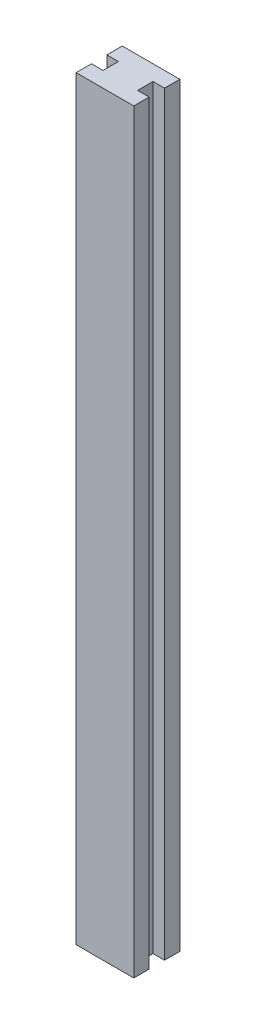
ISO-10303-21;
HEADER;
FILE_DESCRIPTION(('STEP AP214'),'2;1');
FILE_NAME('part.step','',(''),(''),'','','');
FILE_SCHEMA(('AUTOMOTIVE_DESIGN { 1 0 10303 214 1 1 1 1 }'));
ENDSEC;
DATA;
#1=APPLICATION_CONTEXT('core data for automotive mechanical design processes');
#2=APPLICATION_PROTOCOL_DEFINITION('international standard','automotive_design',2000,#1);
#3=PRODUCT_CONTEXT('',#1,'mechanical');
#4=PRODUCT('Part','Part','',(#3));
#5=PRODUCT_RELATED_PRODUCT_CATEGORY('part','',(#4));
#6=PRODUCT_DEFINITION_FORMATION('','',#4);
#7=PRODUCT_DEFINITION_CONTEXT('part definition',#1,'design');
#8=PRODUCT_DEFINITION('design','',#6,#7);
#9=PRODUCT_DEFINITION_SHAPE('','',#8);
#10=(LENGTH_UNIT() NAMED_UNIT(*) SI_UNIT(.MILLI.,.METRE.));
#11=(NAMED_UNIT(*) PLANE_ANGLE_UNIT() SI_UNIT($,.RADIAN.));
#12=(NAMED_UNIT(*) SI_UNIT($,.STERADIAN.) SOLID_ANGLE_UNIT());
#13=UNCERTAINTY_MEASURE_WITH_UNIT(LENGTH_MEASURE(1.E-05),#10,'distance_accuracy_value','');
#14=(GEOMETRIC_REPRESENTATION_CONTEXT(3) GLOBAL_UNCERTAINTY_ASSIGNED_CONTEXT((#13)) GLOBAL_UNIT_ASSIGNED_CONTEXT((#10,
#11,#12)) REPRESENTATION_CONTEXT('',''));
#15=CARTESIAN_POINT('',(0.,0.,0.));
#16=DIRECTION('',(0.,0.,1.));
#17=DIRECTION('',(1.,0.,0.));
#18=AXIS2_PLACEMENT_3D('',#15,#16,#17);
#19=CARTESIAN_POINT('',(0.,65.5,-1.33333333333333));
#20=DIRECTION('',(1.,0.,0.));
#21=DIRECTION('',(0.,0.,-1.));
#22=AXIS2_PLACEMENT_3D('',#19,#20,#21);
#23=PLANE('',#22);
#24=DIRECTION('',(0.,0.,1.));
#25=VECTOR('',#24,1.);
#26=CARTESIAN_POINT('',(0.,0.,-1.33333333333333));
#27=LINE('',#26,#25);
#28=CARTESIAN_POINT('',(0.,0.,-1.33333333333333));
#29=VERTEX_POINT('',#28);
#30=CARTESIAN_POINT('',(0.,0.,0.));
#31=VERTEX_POINT('',#30);
#32=EDGE_CURVE('E155',#29,#31,#27,.T.);
#33=ORIENTED_EDGE('',*,*,#32,.T.);
#34=DIRECTION('',(0.,-1.,0.));
#35=VECTOR('',#34,1.);
#36=CARTESIAN_POINT('',(0.,65.5,0.));
#37=LINE('',#36,#35);
#38=CARTESIAN_POINT('',(0.,65.5,0.));
#39=VERTEX_POINT('',#38);
#40=EDGE_CURVE('E11',#39,#31,#37,.T.);
#41=ORIENTED_EDGE('',*,*,#40,.F.);
#42=DIRECTION('',(0.,0.,1.));
#43=VECTOR('',#42,1.);
#44=CARTESIAN_POINT('',(0.,65.5,-1.33333333333333));
#45=LINE('',#44,#43);
#46=CARTESIAN_POINT('',(0.,65.5,-1.33333333333333));
#47=VERTEX_POINT('',#46);
#48=EDGE_CURVE('E177',#47,#39,#45,.T.);
#49=ORIENTED_EDGE('',*,*,#48,.F.);
#50=DIRECTION('',(0.,-1.,0.));
#51=VECTOR('',#50,1.);
#52=CARTESIAN_POINT('',(0.,65.5,-1.33333333333333));
#53=LINE('',#52,#51);
#54=EDGE_CURVE('E151',#47,#29,#53,.T.);
#55=ORIENTED_EDGE('',*,*,#54,.T.);
#56=EDGE_LOOP('',(#33,#41,#49,#55));
#57=FACE_BOUND('',#56,.T.);
#58=ADVANCED_FACE('F35',(#57),#23,.F.);
#59=CARTESIAN_POINT('',(0.,65.5,0.));
#60=DIRECTION('',(0.,0.,-1.));
#61=DIRECTION('',(-1.,0.,0.));
#62=AXIS2_PLACEMENT_3D('',#59,#60,#61);
#63=PLANE('',#62);
#64=DIRECTION('',(1.,0.,0.));
#65=VECTOR('',#64,1.);
#66=CARTESIAN_POINT('',(0.,0.,0.));
#67=LINE('',#66,#65);
#68=CARTESIAN_POINT('',(5.,0.,0.));
#69=VERTEX_POINT('',#68);
#70=EDGE_CURVE('E158',#31,#69,#67,.T.);
#71=ORIENTED_EDGE('',*,*,#70,.T.);
#72=DIRECTION('',(0.,-1.,0.));
#73=VECTOR('',#72,1.);
#74=CARTESIAN_POINT('',(5.,65.5,0.));
#75=LINE('',#74,#73);
#76=CARTESIAN_POINT('',(5.,65.5,0.));
#77=VERTEX_POINT('',#76);
#78=EDGE_CURVE('E43',#77,#69,#75,.T.);
#79=ORIENTED_EDGE('',*,*,#78,.F.);
#80=DIRECTION('',(1.,0.,0.));
#81=VECTOR('',#80,1.);
#82=CARTESIAN_POINT('',(0.,65.5,0.));
#83=LINE('',#82,#81);
#84=EDGE_CURVE('E106',#39,#77,#83,.T.);
#85=ORIENTED_EDGE('',*,*,#84,.F.);
#86=ORIENTED_EDGE('',*,*,#40,.T.);
#87=EDGE_LOOP('',(#71,#79,#85,#86));
#88=FACE_BOUND('',#87,.T.);
#89=ADVANCED_FACE('F255',(#88),#63,.F.);
#90=CARTESIAN_POINT('',(5.,65.5,0.));
#91=DIRECTION('',(-1.,0.,0.));
#92=DIRECTION('',(0.,0.,1.));
#93=AXIS2_PLACEMENT_3D('',#90,#91,#92);
#94=PLANE('',#93);
#95=DIRECTION('',(0.,0.,-1.));
#96=VECTOR('',#95,1.);
#97=CARTESIAN_POINT('',(5.,0.,0.));
#98=LINE('',#97,#96);
#99=CARTESIAN_POINT('',(5.,0.,-1.33333333333333));
#100=VERTEX_POINT('',#99);
#101=EDGE_CURVE('E160',#69,#100,#98,.T.);
#102=ORIENTED_EDGE('',*,*,#101,.T.);
#103=DIRECTION('',(0.,-1.,0.));
#104=VECTOR('',#103,1.);
#105=CARTESIAN_POINT('',(5.,65.5,-1.33333333333333));
#106=LINE('',#105,#104);
#107=CARTESIAN_POINT('',(5.,65.5,-1.33333333333333));
#108=VERTEX_POINT('',#107);
#109=EDGE_CURVE('E196',#108,#100,#106,.T.);
#110=ORIENTED_EDGE('',*,*,#109,.F.);
#111=DIRECTION('',(0.,0.,-1.));
#112=VECTOR('',#111,1.);
#113=CARTESIAN_POINT('',(5.,65.5,0.));
#114=LINE('',#113,#112);
#115=EDGE_CURVE('E204',#77,#108,#114,.T.);
#116=ORIENTED_EDGE('',*,*,#115,.F.);
#117=ORIENTED_EDGE('',*,*,#78,.T.);
#118=EDGE_LOOP('',(#102,#110,#116,#117));
#119=FACE_BOUND('',#118,.T.);
#120=ADVANCED_FACE('F202',(#119),#94,.F.);
#121=CARTESIAN_POINT('',(5.,65.5,-1.33333333333333));
#122=DIRECTION('',(0.,0.,1.));
#123=DIRECTION('',(1.,0.,0.));
#124=AXIS2_PLACEMENT_3D('',#121,#122,#123);
#125=PLANE('',#124);
#126=DIRECTION('',(-1.,0.,0.));
#127=VECTOR('',#126,1.);
#128=CARTESIAN_POINT('',(5.,0.,-1.33333333333333));
#129=LINE('',#128,#127);
#130=CARTESIAN_POINT('',(4.,0.,-1.33333333333333));
#131=VERTEX_POINT('',#130);
#132=EDGE_CURVE('E162',#100,#131,#129,.T.);
#133=ORIENTED_EDGE('',*,*,#132,.T.);
#134=DIRECTION('',(0.,-1.,0.));
#135=VECTOR('',#134,1.);
#136=CARTESIAN_POINT('',(4.,65.5,-1.33333333333333));
#137=LINE('',#136,#135);
#138=CARTESIAN_POINT('',(4.,65.5,-1.33333333333333));
#139=VERTEX_POINT('',#138);
#140=EDGE_CURVE('E193',#139,#131,#137,.T.);
#141=ORIENTED_EDGE('',*,*,#140,.F.);
#142=DIRECTION('',(-1.,0.,0.));
#143=VECTOR('',#142,1.);
#144=CARTESIAN_POINT('',(5.,65.5,-1.33333333333333));
#145=LINE('',#144,#143);
#146=EDGE_CURVE('E222',#108,#139,#145,.T.);
#147=ORIENTED_EDGE('',*,*,#146,.F.);
#148=ORIENTED_EDGE('',*,*,#109,.T.);
#149=EDGE_LOOP('',(#133,#141,#147,#148));
#150=FACE_BOUND('',#149,.T.);
#151=ADVANCED_FACE('F213',(#150),#125,.F.);
#152=CARTESIAN_POINT('',(4.,65.5,-1.33333333333333));
#153=DIRECTION('',(-1.,0.,0.));
#154=DIRECTION('',(0.,0.,1.));
#155=AXIS2_PLACEMENT_3D('',#152,#153,#154);
#156=PLANE('',#155);
#157=DIRECTION('',(0.,0.,-1.));
#158=VECTOR('',#157,1.);
#159=CARTESIAN_POINT('',(4.,0.,-1.33333333333333));
#160=LINE('',#159,#158);
#161=CARTESIAN_POINT('',(4.,0.,-2.66666666666667));
#162=VERTEX_POINT('',#161);
#163=EDGE_CURVE('E164',#131,#162,#160,.T.);
#164=ORIENTED_EDGE('',*,*,#163,.T.);
#165=DIRECTION('',(0.,-1.,0.));
#166=VECTOR('',#165,1.);
#167=CARTESIAN_POINT('',(4.,65.5,-2.66666666666667));
#168=LINE('',#167,#166);
#169=CARTESIAN_POINT('',(4.,65.5,-2.66666666666667));
#170=VERTEX_POINT('',#169);
#171=EDGE_CURVE('E190',#170,#162,#168,.T.);
#172=ORIENTED_EDGE('',*,*,#171,.F.);
#173=DIRECTION('',(0.,0.,-1.));
#174=VECTOR('',#173,1.);
#175=CARTESIAN_POINT('',(4.,65.5,-1.33333333333333));
#176=LINE('',#175,#174);
#177=EDGE_CURVE('E219',#139,#170,#176,.T.);
#178=ORIENTED_EDGE('',*,*,#177,.F.);
#179=ORIENTED_EDGE('',*,*,#140,.T.);
#180=EDGE_LOOP('',(#164,#172,#178,#179));
#181=FACE_BOUND('',#180,.T.);
#182=ADVANCED_FACE('F217',(#181),#156,.F.);
#183=CARTESIAN_POINT('',(4.,65.5,-2.66666666666667));
#184=DIRECTION('',(0.,0.,-1.));
#185=DIRECTION('',(-1.,0.,0.));
#186=AXIS2_PLACEMENT_3D('',#183,#184,#185);
#187=PLANE('',#186);
#188=DIRECTION('',(1.,0.,0.));
#189=VECTOR('',#188,1.);
#190=CARTESIAN_POINT('',(4.,0.,-2.66666666666667));
#191=LINE('',#190,#189);
#192=CARTESIAN_POINT('',(5.,0.,-2.66666666666667));
#193=VERTEX_POINT('',#192);
#194=EDGE_CURVE('E166',#162,#193,#191,.T.);
#195=ORIENTED_EDGE('',*,*,#194,.T.);
#196=DIRECTION('',(0.,-1.,0.));
#197=VECTOR('',#196,1.);
#198=CARTESIAN_POINT('',(5.,65.5,-2.66666666666667));
#199=LINE('',#198,#197);
#200=CARTESIAN_POINT('',(5.,65.5,-2.66666666666667));
#201=VERTEX_POINT('',#200);
#202=EDGE_CURVE('E187',#201,#193,#199,.T.);
#203=ORIENTED_EDGE('',*,*,#202,.F.);
#204=DIRECTION('',(1.,0.,0.));
#205=VECTOR('',#204,1.);
#206=CARTESIAN_POINT('',(4.,65.5,-2.66666666666667));
#207=LINE('',#206,#205);
#208=EDGE_CURVE('E221',#170,#201,#207,.T.);
#209=ORIENTED_EDGE('',*,*,#208,.F.);
#210=ORIENTED_EDGE('',*,*,#171,.T.);
#211=EDGE_LOOP('',(#195,#203,#209,#210));
#212=FACE_BOUND('',#211,.T.);
#213=ADVANCED_FACE('F268',(#212),#187,.F.);
#214=CARTESIAN_POINT('',(5.,65.5,-2.66666666666667));
#215=DIRECTION('',(-1.,0.,0.));
#216=DIRECTION('',(0.,0.,1.));
#217=AXIS2_PLACEMENT_3D('',#214,#215,#216);
#218=PLANE('',#217);
#219=DIRECTION('',(0.,0.,-1.));
#220=VECTOR('',#219,1.);
#221=CARTESIAN_POINT('',(5.,0.,-2.66666666666667));
#222=LINE('',#221,#220);
#223=CARTESIAN_POINT('',(5.,0.,-4.));
#224=VERTEX_POINT('',#223);
#225=EDGE_CURVE('E168',#193,#224,#222,.T.);
#226=ORIENTED_EDGE('',*,*,#225,.T.);
#227=DIRECTION('',(0.,-1.,0.));
#228=VECTOR('',#227,1.);
#229=CARTESIAN_POINT('',(5.,65.5,-4.));
#230=LINE('',#229,#228);
#231=CARTESIAN_POINT('',(5.,65.5,-4.));
#232=VERTEX_POINT('',#231);
#233=EDGE_CURVE('E184',#232,#224,#230,.T.);
#234=ORIENTED_EDGE('',*,*,#233,.F.);
#235=DIRECTION('',(0.,0.,-1.));
#236=VECTOR('',#235,1.);
#237=CARTESIAN_POINT('',(5.,65.5,-2.66666666666667));
#238=LINE('',#237,#236);
#239=EDGE_CURVE('E224',#201,#232,#238,.T.);
#240=ORIENTED_EDGE('',*,*,#239,.F.);
#241=ORIENTED_EDGE('',*,*,#202,.T.);
#242=EDGE_LOOP('',(#226,#234,#240,#241));
#243=FACE_BOUND('',#242,.T.);
#244=ADVANCED_FACE('F271',(#243),#218,.F.);
#245=CARTESIAN_POINT('',(5.,65.5,-4.));
#246=DIRECTION('',(0.,0.,1.));
#247=DIRECTION('',(1.,0.,0.));
#248=AXIS2_PLACEMENT_3D('',#245,#246,#247);
#249=PLANE('',#248);
#250=DIRECTION('',(-1.,0.,0.));
#251=VECTOR('',#250,1.);
#252=CARTESIAN_POINT('',(5.,0.,-4.));
#253=LINE('',#252,#251);
#254=CARTESIAN_POINT('',(0.,0.,-4.));
#255=VERTEX_POINT('',#254);
#256=EDGE_CURVE('E170',#224,#255,#253,.T.);
#257=ORIENTED_EDGE('',*,*,#256,.T.);
#258=DIRECTION('',(0.,-1.,0.));
#259=VECTOR('',#258,1.);
#260=CARTESIAN_POINT('',(0.,65.5,-4.));
#261=LINE('',#260,#259);
#262=CARTESIAN_POINT('',(0.,65.5,-4.));
#263=VERTEX_POINT('',#262);
#264=EDGE_CURVE('E181',#263,#255,#261,.T.);
#265=ORIENTED_EDGE('',*,*,#264,.F.);
#266=DIRECTION('',(-1.,0.,0.));
#267=VECTOR('',#266,1.);
#268=CARTESIAN_POINT('',(5.,65.5,-4.));
#269=LINE('',#268,#267);
#270=EDGE_CURVE('E230',#232,#263,#269,.T.);
#271=ORIENTED_EDGE('',*,*,#270,.F.);
#272=ORIENTED_EDGE('',*,*,#233,.T.);
#273=EDGE_LOOP('',(#257,#265,#271,#272));
#274=FACE_BOUND('',#273,.T.);
#275=ADVANCED_FACE('F236',(#274),#249,.F.);
#276=CARTESIAN_POINT('',(0.,65.5,-4.));
#277=DIRECTION('',(1.,0.,0.));
#278=DIRECTION('',(0.,0.,-1.));
#279=AXIS2_PLACEMENT_3D('',#276,#277,#278);
#280=PLANE('',#279);
#281=DIRECTION('',(0.,0.,1.));
#282=VECTOR('',#281,1.);
#283=CARTESIAN_POINT('',(0.,0.,-4.));
#284=LINE('',#283,#282);
#285=CARTESIAN_POINT('',(0.,0.,-2.66666666666667));
#286=VERTEX_POINT('',#285);
#287=EDGE_CURVE('E172',#255,#286,#284,.T.);
#288=ORIENTED_EDGE('',*,*,#287,.T.);
#289=DIRECTION('',(0.,-1.,0.));
#290=VECTOR('',#289,1.);
#291=CARTESIAN_POINT('',(0.,65.5,-2.66666666666667));
#292=LINE('',#291,#290);
#293=CARTESIAN_POINT('',(0.,65.5,-2.66666666666667));
#294=VERTEX_POINT('',#293);
#295=EDGE_CURVE('E146',#294,#286,#292,.T.);
#296=ORIENTED_EDGE('',*,*,#295,.F.);
#297=DIRECTION('',(0.,0.,1.));
#298=VECTOR('',#297,1.);
#299=CARTESIAN_POINT('',(0.,65.5,-4.));
#300=LINE('',#299,#298);
#301=EDGE_CURVE('E137',#263,#294,#300,.T.);
#302=ORIENTED_EDGE('',*,*,#301,.F.);
#303=ORIENTED_EDGE('',*,*,#264,.T.);
#304=EDGE_LOOP('',(#288,#296,#302,#303));
#305=FACE_BOUND('',#304,.T.);
#306=ADVANCED_FACE('F240',(#305),#280,.F.);
#307=CARTESIAN_POINT('',(0.,65.5,-2.66666666666667));
#308=DIRECTION('',(0.,0.,-1.));
#309=DIRECTION('',(-1.,0.,0.));
#310=AXIS2_PLACEMENT_3D('',#307,#308,#309);
#311=PLANE('',#310);
#312=DIRECTION('',(1.,0.,0.));
#313=VECTOR('',#312,1.);
#314=CARTESIAN_POINT('',(0.,0.,-2.66666666666667));
#315=LINE('',#314,#313);
#316=CARTESIAN_POINT('',(1.,0.,-2.66666666666667));
#317=VERTEX_POINT('',#316);
#318=EDGE_CURVE('E145',#286,#317,#315,.T.);
#319=ORIENTED_EDGE('',*,*,#318,.T.);
#320=DIRECTION('',(0.,-1.,0.));
#321=VECTOR('',#320,1.);
#322=CARTESIAN_POINT('',(1.,65.5,-2.66666666666667));
#323=LINE('',#322,#321);
#324=CARTESIAN_POINT('',(1.,65.5,-2.66666666666667));
#325=VERTEX_POINT('',#324);
#326=EDGE_CURVE('E142',#325,#317,#323,.T.);
#327=ORIENTED_EDGE('',*,*,#326,.F.);
#328=DIRECTION('',(1.,0.,0.));
#329=VECTOR('',#328,1.);
#330=CARTESIAN_POINT('',(0.,65.5,-2.66666666666667));
#331=LINE('',#330,#329);
#332=EDGE_CURVE('E131',#294,#325,#331,.T.);
#333=ORIENTED_EDGE('',*,*,#332,.F.);
#334=ORIENTED_EDGE('',*,*,#295,.T.);
#335=EDGE_LOOP('',(#319,#327,#333,#334));
#336=FACE_BOUND('',#335,.T.);
#337=ADVANCED_FACE('F143',(#336),#311,.F.);
#338=CARTESIAN_POINT('',(1.,65.5,-2.66666666666667));
#339=DIRECTION('',(1.,0.,0.));
#340=DIRECTION('',(0.,0.,-1.));
#341=AXIS2_PLACEMENT_3D('',#338,#339,#340);
#342=PLANE('',#341);
#343=DIRECTION('',(0.,0.,1.));
#344=VECTOR('',#343,1.);
#345=CARTESIAN_POINT('',(1.,0.,-2.66666666666667));
#346=LINE('',#345,#344);
#347=CARTESIAN_POINT('',(1.,0.,-1.33333333333333));
#348=VERTEX_POINT('',#347);
#349=EDGE_CURVE('E92',#317,#348,#346,.T.);
#350=ORIENTED_EDGE('',*,*,#349,.T.);
#351=DIRECTION('',(0.,-1.,0.));
#352=VECTOR('',#351,1.);
#353=CARTESIAN_POINT('',(1.,65.5,-1.33333333333333));
#354=LINE('',#353,#352);
#355=CARTESIAN_POINT('',(1.,65.5,-1.33333333333333));
#356=VERTEX_POINT('',#355);
#357=EDGE_CURVE('E147',#356,#348,#354,.T.);
#358=ORIENTED_EDGE('',*,*,#357,.F.);
#359=DIRECTION('',(0.,0.,1.));
#360=VECTOR('',#359,1.);
#361=CARTESIAN_POINT('',(1.,65.5,-2.66666666666667));
#362=LINE('',#361,#360);
#363=EDGE_CURVE('E135',#325,#356,#362,.T.);
#364=ORIENTED_EDGE('',*,*,#363,.F.);
#365=ORIENTED_EDGE('',*,*,#326,.T.);
#366=EDGE_LOOP('',(#350,#358,#364,#365));
#367=FACE_BOUND('',#366,.T.);
#368=ADVANCED_FACE('F149',(#367),#342,.F.);
#369=CARTESIAN_POINT('',(1.,65.5,-1.33333333333333));
#370=DIRECTION('',(0.,0.,1.));
#371=DIRECTION('',(1.,0.,0.));
#372=AXIS2_PLACEMENT_3D('',#369,#370,#371);
#373=PLANE('',#372);
#374=DIRECTION('',(-1.,0.,0.));
#375=VECTOR('',#374,1.);
#376=CARTESIAN_POINT('',(1.,0.,-1.33333333333333));
#377=LINE('',#376,#375);
#378=EDGE_CURVE('E98',#348,#29,#377,.T.);
#379=ORIENTED_EDGE('',*,*,#378,.T.);
#380=ORIENTED_EDGE('',*,*,#54,.F.);
#381=DIRECTION('',(-1.,0.,0.));
#382=VECTOR('',#381,1.);
#383=CARTESIAN_POINT('',(1.,65.5,-1.33333333333333));
#384=LINE('',#383,#382);
#385=EDGE_CURVE('E51',#356,#47,#384,.T.);
#386=ORIENTED_EDGE('',*,*,#385,.F.);
#387=ORIENTED_EDGE('',*,*,#357,.T.);
#388=EDGE_LOOP('',(#379,#380,#386,#387));
#389=FACE_BOUND('',#388,.T.);
#390=ADVANCED_FACE('F244',(#389),#373,.F.);
#391=CARTESIAN_POINT('',(0.,65.5,0.));
#392=DIRECTION('',(0.,1.,0.));
#393=DIRECTION('',(0.,0.,1.));
#394=AXIS2_PLACEMENT_3D('',#391,#392,#393);
#395=PLANE('',#394);
#396=ORIENTED_EDGE('',*,*,#48,.T.);
#397=ORIENTED_EDGE('',*,*,#84,.T.);
#398=ORIENTED_EDGE('',*,*,#115,.T.);
#399=ORIENTED_EDGE('',*,*,#146,.T.);
#400=ORIENTED_EDGE('',*,*,#177,.T.);
#401=ORIENTED_EDGE('',*,*,#208,.T.);
#402=ORIENTED_EDGE('',*,*,#239,.T.);
#403=ORIENTED_EDGE('',*,*,#270,.T.);
#404=ORIENTED_EDGE('',*,*,#301,.T.);
#405=ORIENTED_EDGE('',*,*,#332,.T.);
#406=ORIENTED_EDGE('',*,*,#363,.T.);
#407=ORIENTED_EDGE('',*,*,#385,.T.);
#408=EDGE_LOOP('',(#396,#397,#398,#399,#400,#401,#402,#403,#404,#405,#406,#407));
#409=FACE_BOUND('',#408,.T.);
#410=ADVANCED_FACE('F133',(#409),#395,.T.);
#411=CARTESIAN_POINT('',(0.,0.,0.));
#412=DIRECTION('',(0.,1.,0.));
#413=DIRECTION('',(0.,0.,1.));
#414=AXIS2_PLACEMENT_3D('',#411,#412,#413);
#415=PLANE('',#414);
#416=ORIENTED_EDGE('',*,*,#32,.F.);
#417=ORIENTED_EDGE('',*,*,#378,.F.);
#418=ORIENTED_EDGE('',*,*,#349,.F.);
#419=ORIENTED_EDGE('',*,*,#318,.F.);
#420=ORIENTED_EDGE('',*,*,#287,.F.);
#421=ORIENTED_EDGE('',*,*,#256,.F.);
#422=ORIENTED_EDGE('',*,*,#225,.F.);
#423=ORIENTED_EDGE('',*,*,#194,.F.);
#424=ORIENTED_EDGE('',*,*,#163,.F.);
#425=ORIENTED_EDGE('',*,*,#132,.F.);
#426=ORIENTED_EDGE('',*,*,#101,.F.);
#427=ORIENTED_EDGE('',*,*,#70,.F.);
#428=EDGE_LOOP('',(#416,#417,#418,#419,#420,#421,#422,#423,#424,#425,#426,#427));
#429=FACE_BOUND('',#428,.T.);
#430=ADVANCED_FACE('F208',(#429),#415,.F.);
#431=CLOSED_SHELL('',(#58,#89,#120,#151,#182,#213,#244,#275,#306,#337,#368,#390,#410,#430));
#432=MANIFOLD_SOLID_BREP('B2',#431);
#433=ADVANCED_BREP_SHAPE_REPRESENTATION('',(#18,#432),#14);
#434=SHAPE_DEFINITION_REPRESENTATION(#9,#433);
ENDSEC;
END-ISO-10303-21;
